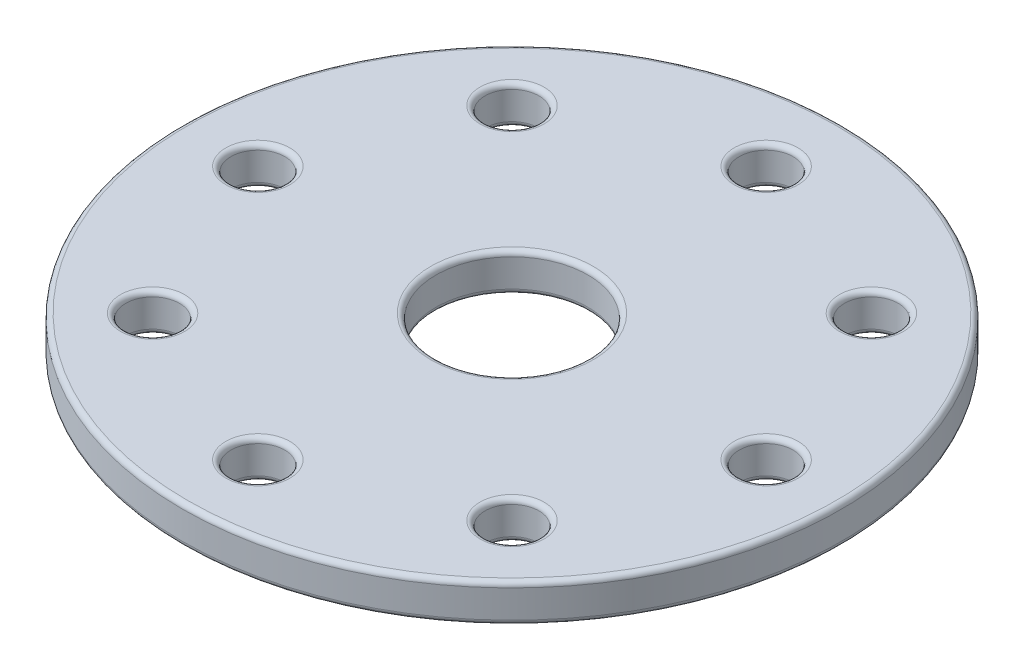
ISO-10303-21;
HEADER;
FILE_DESCRIPTION(('STEP AP214'),'2;1');
FILE_NAME('part.step','',(''),(''),'','','');
FILE_SCHEMA(('AUTOMOTIVE_DESIGN { 1 0 10303 214 1 1 1 1 }'));
ENDSEC;
DATA;
#1=APPLICATION_CONTEXT('core data for automotive mechanical design processes');
#2=APPLICATION_PROTOCOL_DEFINITION('international standard','automotive_design',2000,#1);
#3=PRODUCT_CONTEXT('',#1,'mechanical');
#4=PRODUCT('Part','Part','',(#3));
#5=PRODUCT_RELATED_PRODUCT_CATEGORY('part','',(#4));
#6=PRODUCT_DEFINITION_FORMATION('','',#4);
#7=PRODUCT_DEFINITION_CONTEXT('part definition',#1,'design');
#8=PRODUCT_DEFINITION('design','',#6,#7);
#9=PRODUCT_DEFINITION_SHAPE('','',#8);
#10=(LENGTH_UNIT() NAMED_UNIT(*) SI_UNIT(.MILLI.,.METRE.));
#11=(NAMED_UNIT(*) PLANE_ANGLE_UNIT() SI_UNIT($,.RADIAN.));
#12=(NAMED_UNIT(*) SI_UNIT($,.STERADIAN.) SOLID_ANGLE_UNIT());
#13=UNCERTAINTY_MEASURE_WITH_UNIT(LENGTH_MEASURE(1.E-05),#10,'distance_accuracy_value','');
#14=(GEOMETRIC_REPRESENTATION_CONTEXT(3) GLOBAL_UNCERTAINTY_ASSIGNED_CONTEXT((#13)) GLOBAL_UNIT_ASSIGNED_CONTEXT((#10,
#11,#12)) REPRESENTATION_CONTEXT('',''));
#15=CARTESIAN_POINT('',(0.,0.,0.));
#16=DIRECTION('',(0.,0.,1.));
#17=DIRECTION('',(1.,0.,0.));
#18=AXIS2_PLACEMENT_3D('',#15,#16,#17);
#19=CARTESIAN_POINT('',(0.,1.875,0.));
#20=DIRECTION('',(0.,-1.,0.));
#21=DIRECTION('',(0.,0.,-1.));
#22=AXIS2_PLACEMENT_3D('',#19,#20,#21);
#23=CYLINDRICAL_SURFACE('',#22,32.5);
#24=CARTESIAN_POINT('',(0.,-1.375,0.));
#25=DIRECTION('',(0.,1.,0.));
#26=DIRECTION('',(0.,0.,1.));
#27=AXIS2_PLACEMENT_3D('',#24,#25,#26);
#28=CIRCLE('',#27,32.5);
#29=CARTESIAN_POINT('',(0.,-1.375,32.5));
#30=VERTEX_POINT('',#29);
#31=EDGE_CURVE('E153',#30,#30,#28,.T.);
#32=ORIENTED_EDGE('',*,*,#31,.T.);
#33=EDGE_LOOP('',(#32));
#34=FACE_BOUND('',#33,.T.);
#35=CARTESIAN_POINT('',(0.,1.375,0.));
#36=DIRECTION('',(0.,1.,0.));
#37=DIRECTION('',(0.,0.,1.));
#38=AXIS2_PLACEMENT_3D('',#35,#36,#37);
#39=CIRCLE('',#38,32.5);
#40=CARTESIAN_POINT('',(0.,1.375,32.5));
#41=VERTEX_POINT('',#40);
#42=EDGE_CURVE('E156',#41,#41,#39,.F.);
#43=ORIENTED_EDGE('',*,*,#42,.T.);
#44=EDGE_LOOP('',(#43));
#45=FACE_BOUND('',#44,.T.);
#46=ADVANCED_FACE('F31',(#34,#45),#23,.T.);
#47=CARTESIAN_POINT('',(0.,1.875,0.));
#48=DIRECTION('',(0.,1.,0.));
#49=DIRECTION('',(0.,0.,1.));
#50=AXIS2_PLACEMENT_3D('',#47,#48,#49);
#51=PLANE('',#50);
#52=CARTESIAN_POINT('',(0.,1.875,0.));
#53=DIRECTION('',(0.,1.,0.));
#54=DIRECTION('',(0.,0.,1.));
#55=AXIS2_PLACEMENT_3D('',#52,#53,#54);
#56=CIRCLE('',#55,32.);
#57=CARTESIAN_POINT('',(0.,1.875,32.));
#58=VERTEX_POINT('',#57);
#59=EDGE_CURVE('E10',#58,#58,#56,.T.);
#60=ORIENTED_EDGE('',*,*,#59,.T.);
#61=EDGE_LOOP('',(#60));
#62=FACE_BOUND('',#61,.T.);
#63=CARTESIAN_POINT('',(0.,1.875,0.));
#64=DIRECTION('',(0.,1.,0.));
#65=DIRECTION('',(0.,0.,1.));
#66=AXIS2_PLACEMENT_3D('',#63,#64,#65);
#67=CIRCLE('',#66,8.);
#68=CARTESIAN_POINT('',(0.,1.875,8.));
#69=VERTEX_POINT('',#68);
#70=EDGE_CURVE('E38',#69,#69,#67,.F.);
#71=ORIENTED_EDGE('',*,*,#70,.T.);
#72=EDGE_LOOP('',(#71));
#73=FACE_BOUND('',#72,.T.);
#74=CARTESIAN_POINT('',(0.,1.875,-25.0625));
#75=DIRECTION('',(0.,1.,0.));
#76=DIRECTION('',(0.,0.,1.));
#77=AXIS2_PLACEMENT_3D('',#74,#75,#76);
#78=CIRCLE('',#77,3.15625);
#79=CARTESIAN_POINT('',(0.,1.875,-21.90625));
#80=VERTEX_POINT('',#79);
#81=EDGE_CURVE('E42',#80,#80,#78,.F.);
#82=ORIENTED_EDGE('',*,*,#81,.T.);
#83=EDGE_LOOP('',(#82));
#84=FACE_BOUND('',#83,.T.);
#85=CARTESIAN_POINT('',(-17.7218637034879,1.875,-17.7218637034878));
#86=DIRECTION('',(0.,1.,0.));
#87=DIRECTION('',(0.,0.,1.));
#88=AXIS2_PLACEMENT_3D('',#85,#86,#87);
#89=CIRCLE('',#88,3.15625);
#90=CARTESIAN_POINT('',(-17.7218637034879,1.875,-14.5656137034878));
#91=VERTEX_POINT('',#90);
#92=EDGE_CURVE('E46',#91,#91,#89,.F.);
#93=ORIENTED_EDGE('',*,*,#92,.T.);
#94=EDGE_LOOP('',(#93));
#95=FACE_BOUND('',#94,.T.);
#96=CARTESIAN_POINT('',(17.7218637034876,1.875,-17.7218637034881));
#97=DIRECTION('',(0.,1.,0.));
#98=DIRECTION('',(0.,0.,1.));
#99=AXIS2_PLACEMENT_3D('',#96,#97,#98);
#100=CIRCLE('',#99,3.15625);
#101=CARTESIAN_POINT('',(17.7218637034876,1.875,-14.5656137034881));
#102=VERTEX_POINT('',#101);
#103=EDGE_CURVE('E51',#102,#102,#100,.F.);
#104=ORIENTED_EDGE('',*,*,#103,.T.);
#105=EDGE_LOOP('',(#104));
#106=FACE_BOUND('',#105,.T.);
#107=CARTESIAN_POINT('',(25.0625,1.875,-2.61604922107402E-13));
#108=DIRECTION('',(0.,1.,0.));
#109=DIRECTION('',(0.,0.,1.));
#110=AXIS2_PLACEMENT_3D('',#107,#108,#109);
#111=CIRCLE('',#110,3.15625);
#112=CARTESIAN_POINT('',(25.0625,1.875,3.15624999999974));
#113=VERTEX_POINT('',#112);
#114=EDGE_CURVE('E54',#113,#113,#111,.F.);
#115=ORIENTED_EDGE('',*,*,#114,.T.);
#116=EDGE_LOOP('',(#115));
#117=FACE_BOUND('',#116,.T.);
#118=CARTESIAN_POINT('',(17.721863703488,1.875,17.7218637034877));
#119=DIRECTION('',(0.,1.,0.));
#120=DIRECTION('',(0.,0.,1.));
#121=AXIS2_PLACEMENT_3D('',#118,#119,#120);
#122=CIRCLE('',#121,3.15625);
#123=CARTESIAN_POINT('',(17.721863703488,1.875,20.8781137034877));
#124=VERTEX_POINT('',#123);
#125=EDGE_CURVE('E57',#124,#124,#122,.F.);
#126=ORIENTED_EDGE('',*,*,#125,.T.);
#127=EDGE_LOOP('',(#126));
#128=FACE_BOUND('',#127,.T.);
#129=CARTESIAN_POINT('',(0.,1.875,25.0625));
#130=DIRECTION('',(0.,1.,0.));
#131=DIRECTION('',(0.,0.,1.));
#132=AXIS2_PLACEMENT_3D('',#129,#130,#131);
#133=CIRCLE('',#132,3.15625);
#134=CARTESIAN_POINT('',(0.,1.875,28.21875));
#135=VERTEX_POINT('',#134);
#136=EDGE_CURVE('E60',#135,#135,#133,.F.);
#137=ORIENTED_EDGE('',*,*,#136,.T.);
#138=EDGE_LOOP('',(#137));
#139=FACE_BOUND('',#138,.T.);
#140=CARTESIAN_POINT('',(-17.7218637034878,1.875,17.7218637034879));
#141=DIRECTION('',(0.,1.,0.));
#142=DIRECTION('',(0.,0.,1.));
#143=AXIS2_PLACEMENT_3D('',#140,#141,#142);
#144=CIRCLE('',#143,3.15625);
#145=CARTESIAN_POINT('',(-17.7218637034878,1.875,20.8781137034879));
#146=VERTEX_POINT('',#145);
#147=EDGE_CURVE('E63',#146,#146,#144,.F.);
#148=ORIENTED_EDGE('',*,*,#147,.T.);
#149=EDGE_LOOP('',(#148));
#150=FACE_BOUND('',#149,.T.);
#151=CARTESIAN_POINT('',(-25.0625,1.875,0.));
#152=DIRECTION('',(0.,1.,0.));
#153=DIRECTION('',(0.,0.,1.));
#154=AXIS2_PLACEMENT_3D('',#151,#152,#153);
#155=CIRCLE('',#154,3.15625);
#156=CARTESIAN_POINT('',(-25.0625,1.875,3.15625000000009));
#157=VERTEX_POINT('',#156);
#158=EDGE_CURVE('E66',#157,#157,#155,.F.);
#159=ORIENTED_EDGE('',*,*,#158,.T.);
#160=EDGE_LOOP('',(#159));
#161=FACE_BOUND('',#160,.T.);
#162=ADVANCED_FACE('F178',(#62,#73,#84,#95,#106,#117,#128,#139,#150,#161),#51,.T.);
#163=CARTESIAN_POINT('',(0.,-1.875,0.));
#164=DIRECTION('',(0.,1.,0.));
#165=DIRECTION('',(0.,0.,1.));
#166=AXIS2_PLACEMENT_3D('',#163,#164,#165);
#167=PLANE('',#166);
#168=CARTESIAN_POINT('',(0.,-1.875,0.));
#169=DIRECTION('',(0.,1.,0.));
#170=DIRECTION('',(0.,0.,1.));
#171=AXIS2_PLACEMENT_3D('',#168,#169,#170);
#172=CIRCLE('',#171,32.);
#173=CARTESIAN_POINT('',(0.,-1.875,32.));
#174=VERTEX_POINT('',#173);
#175=EDGE_CURVE('E123',#174,#174,#172,.F.);
#176=ORIENTED_EDGE('',*,*,#175,.T.);
#177=EDGE_LOOP('',(#176));
#178=FACE_BOUND('',#177,.T.);
#179=CARTESIAN_POINT('',(0.,-1.875,0.));
#180=DIRECTION('',(0.,1.,0.));
#181=DIRECTION('',(0.,0.,1.));
#182=AXIS2_PLACEMENT_3D('',#179,#180,#181);
#183=CIRCLE('',#182,8.);
#184=CARTESIAN_POINT('',(0.,-1.875,8.));
#185=VERTEX_POINT('',#184);
#186=EDGE_CURVE('E126',#185,#185,#183,.T.);
#187=ORIENTED_EDGE('',*,*,#186,.T.);
#188=EDGE_LOOP('',(#187));
#189=FACE_BOUND('',#188,.T.);
#190=CARTESIAN_POINT('',(0.,-1.875,-25.0625));
#191=DIRECTION('',(0.,1.,0.));
#192=DIRECTION('',(0.,0.,1.));
#193=AXIS2_PLACEMENT_3D('',#190,#191,#192);
#194=CIRCLE('',#193,3.15625);
#195=CARTESIAN_POINT('',(0.,-1.875,-21.90625));
#196=VERTEX_POINT('',#195);
#197=EDGE_CURVE('E129',#196,#196,#194,.T.);
#198=ORIENTED_EDGE('',*,*,#197,.T.);
#199=EDGE_LOOP('',(#198));
#200=FACE_BOUND('',#199,.T.);
#201=CARTESIAN_POINT('',(-17.7218637034879,-1.875,-17.7218637034878));
#202=DIRECTION('',(0.,1.,0.));
#203=DIRECTION('',(0.,0.,1.));
#204=AXIS2_PLACEMENT_3D('',#201,#202,#203);
#205=CIRCLE('',#204,3.15625);
#206=CARTESIAN_POINT('',(-17.7218637034879,-1.875,-14.5656137034878));
#207=VERTEX_POINT('',#206);
#208=EDGE_CURVE('E132',#207,#207,#205,.T.);
#209=ORIENTED_EDGE('',*,*,#208,.T.);
#210=EDGE_LOOP('',(#209));
#211=FACE_BOUND('',#210,.T.);
#212=CARTESIAN_POINT('',(17.7218637034876,-1.875,-17.7218637034881));
#213=DIRECTION('',(0.,1.,0.));
#214=DIRECTION('',(0.,0.,1.));
#215=AXIS2_PLACEMENT_3D('',#212,#213,#214);
#216=CIRCLE('',#215,3.15625);
#217=CARTESIAN_POINT('',(17.7218637034876,-1.875,-14.5656137034881));
#218=VERTEX_POINT('',#217);
#219=EDGE_CURVE('E135',#218,#218,#216,.T.);
#220=ORIENTED_EDGE('',*,*,#219,.T.);
#221=EDGE_LOOP('',(#220));
#222=FACE_BOUND('',#221,.T.);
#223=CARTESIAN_POINT('',(25.0625,-1.875,-2.61604922107402E-13));
#224=DIRECTION('',(0.,1.,0.));
#225=DIRECTION('',(0.,0.,1.));
#226=AXIS2_PLACEMENT_3D('',#223,#224,#225);
#227=CIRCLE('',#226,3.15625);
#228=CARTESIAN_POINT('',(25.0625,-1.875,3.15624999999974));
#229=VERTEX_POINT('',#228);
#230=EDGE_CURVE('E138',#229,#229,#227,.T.);
#231=ORIENTED_EDGE('',*,*,#230,.T.);
#232=EDGE_LOOP('',(#231));
#233=FACE_BOUND('',#232,.T.);
#234=CARTESIAN_POINT('',(17.721863703488,-1.875,17.7218637034877));
#235=DIRECTION('',(0.,1.,0.));
#236=DIRECTION('',(0.,0.,1.));
#237=AXIS2_PLACEMENT_3D('',#234,#235,#236);
#238=CIRCLE('',#237,3.15625);
#239=CARTESIAN_POINT('',(17.721863703488,-1.875,20.8781137034877));
#240=VERTEX_POINT('',#239);
#241=EDGE_CURVE('E141',#240,#240,#238,.T.);
#242=ORIENTED_EDGE('',*,*,#241,.T.);
#243=EDGE_LOOP('',(#242));
#244=FACE_BOUND('',#243,.T.);
#245=CARTESIAN_POINT('',(0.,-1.875,25.0625));
#246=DIRECTION('',(0.,1.,0.));
#247=DIRECTION('',(0.,0.,1.));
#248=AXIS2_PLACEMENT_3D('',#245,#246,#247);
#249=CIRCLE('',#248,3.15625);
#250=CARTESIAN_POINT('',(0.,-1.875,28.21875));
#251=VERTEX_POINT('',#250);
#252=EDGE_CURVE('E144',#251,#251,#249,.T.);
#253=ORIENTED_EDGE('',*,*,#252,.T.);
#254=EDGE_LOOP('',(#253));
#255=FACE_BOUND('',#254,.T.);
#256=CARTESIAN_POINT('',(-17.7218637034878,-1.875,17.7218637034879));
#257=DIRECTION('',(0.,1.,0.));
#258=DIRECTION('',(0.,0.,1.));
#259=AXIS2_PLACEMENT_3D('',#256,#257,#258);
#260=CIRCLE('',#259,3.15625);
#261=CARTESIAN_POINT('',(-17.7218637034878,-1.875,20.8781137034879));
#262=VERTEX_POINT('',#261);
#263=EDGE_CURVE('E147',#262,#262,#260,.T.);
#264=ORIENTED_EDGE('',*,*,#263,.T.);
#265=EDGE_LOOP('',(#264));
#266=FACE_BOUND('',#265,.T.);
#267=CARTESIAN_POINT('',(-25.0625,-1.875,0.));
#268=DIRECTION('',(0.,1.,0.));
#269=DIRECTION('',(0.,0.,1.));
#270=AXIS2_PLACEMENT_3D('',#267,#268,#269);
#271=CIRCLE('',#270,3.15625);
#272=CARTESIAN_POINT('',(-25.0625,-1.875,3.15625000000009));
#273=VERTEX_POINT('',#272);
#274=EDGE_CURVE('E150',#273,#273,#271,.T.);
#275=ORIENTED_EDGE('',*,*,#274,.T.);
#276=EDGE_LOOP('',(#275));
#277=FACE_BOUND('',#276,.T.);
#278=ADVANCED_FACE('F184',(#178,#189,#200,#211,#222,#233,#244,#255,#266,#277),#167,.F.);
#279=CARTESIAN_POINT('',(0.,-1.875,0.));
#280=DIRECTION('',(0.,1.,0.));
#281=DIRECTION('',(0.,0.,1.));
#282=AXIS2_PLACEMENT_3D('',#279,#280,#281);
#283=CYLINDRICAL_SURFACE('',#282,7.5);
#284=CARTESIAN_POINT('',(0.,-1.375,0.));
#285=DIRECTION('',(0.,1.,0.));
#286=DIRECTION('',(0.,0.,1.));
#287=AXIS2_PLACEMENT_3D('',#284,#285,#286);
#288=CIRCLE('',#287,7.5);
#289=CARTESIAN_POINT('',(0.,-1.375,7.5));
#290=VERTEX_POINT('',#289);
#291=EDGE_CURVE('E117',#290,#290,#288,.F.);
#292=ORIENTED_EDGE('',*,*,#291,.T.);
#293=EDGE_LOOP('',(#292));
#294=FACE_BOUND('',#293,.T.);
#295=CARTESIAN_POINT('',(0.,1.375,0.));
#296=DIRECTION('',(0.,1.,0.));
#297=DIRECTION('',(0.,0.,1.));
#298=AXIS2_PLACEMENT_3D('',#295,#296,#297);
#299=CIRCLE('',#298,7.5);
#300=CARTESIAN_POINT('',(0.,1.375,7.5));
#301=VERTEX_POINT('',#300);
#302=EDGE_CURVE('E120',#301,#301,#299,.T.);
#303=ORIENTED_EDGE('',*,*,#302,.T.);
#304=EDGE_LOOP('',(#303));
#305=FACE_BOUND('',#304,.T.);
#306=ADVANCED_FACE('F231',(#294,#305),#283,.F.);
#307=CARTESIAN_POINT('',(0.,-1.875,-25.0625));
#308=DIRECTION('',(0.,1.,0.));
#309=DIRECTION('',(0.,0.,1.));
#310=AXIS2_PLACEMENT_3D('',#307,#308,#309);
#311=CYLINDRICAL_SURFACE('',#310,2.65625);
#312=CARTESIAN_POINT('',(0.,-1.375,-25.0625));
#313=DIRECTION('',(0.,1.,0.));
#314=DIRECTION('',(0.,0.,1.));
#315=AXIS2_PLACEMENT_3D('',#312,#313,#314);
#316=CIRCLE('',#315,2.65625);
#317=CARTESIAN_POINT('',(0.,-1.375,-22.40625));
#318=VERTEX_POINT('',#317);
#319=EDGE_CURVE('E111',#318,#318,#316,.F.);
#320=ORIENTED_EDGE('',*,*,#319,.T.);
#321=EDGE_LOOP('',(#320));
#322=FACE_BOUND('',#321,.T.);
#323=CARTESIAN_POINT('',(0.,1.375,-25.0625));
#324=DIRECTION('',(0.,1.,0.));
#325=DIRECTION('',(0.,0.,1.));
#326=AXIS2_PLACEMENT_3D('',#323,#324,#325);
#327=CIRCLE('',#326,2.65625);
#328=CARTESIAN_POINT('',(0.,1.375,-22.40625));
#329=VERTEX_POINT('',#328);
#330=EDGE_CURVE('E114',#329,#329,#327,.T.);
#331=ORIENTED_EDGE('',*,*,#330,.T.);
#332=EDGE_LOOP('',(#331));
#333=FACE_BOUND('',#332,.T.);
#334=ADVANCED_FACE('F238',(#322,#333),#311,.F.);
#335=CARTESIAN_POINT('',(-17.7218637034879,-1.875,-17.7218637034878));
#336=DIRECTION('',(0.,1.,0.));
#337=DIRECTION('',(0.,0.,1.));
#338=AXIS2_PLACEMENT_3D('',#335,#336,#337);
#339=CYLINDRICAL_SURFACE('',#338,2.65625);
#340=CARTESIAN_POINT('',(-17.7218637034879,-1.375,-17.7218637034878));
#341=DIRECTION('',(0.,1.,0.));
#342=DIRECTION('',(0.,0.,1.));
#343=AXIS2_PLACEMENT_3D('',#340,#341,#342);
#344=CIRCLE('',#343,2.65625);
#345=CARTESIAN_POINT('',(-17.7218637034879,-1.375,-15.0656137034878));
#346=VERTEX_POINT('',#345);
#347=EDGE_CURVE('E105',#346,#346,#344,.F.);
#348=ORIENTED_EDGE('',*,*,#347,.T.);
#349=EDGE_LOOP('',(#348));
#350=FACE_BOUND('',#349,.T.);
#351=CARTESIAN_POINT('',(-17.7218637034879,1.375,-17.7218637034878));
#352=DIRECTION('',(0.,1.,0.));
#353=DIRECTION('',(0.,0.,1.));
#354=AXIS2_PLACEMENT_3D('',#351,#352,#353);
#355=CIRCLE('',#354,2.65625);
#356=CARTESIAN_POINT('',(-17.7218637034879,1.375,-15.0656137034878));
#357=VERTEX_POINT('',#356);
#358=EDGE_CURVE('E108',#357,#357,#355,.T.);
#359=ORIENTED_EDGE('',*,*,#358,.T.);
#360=EDGE_LOOP('',(#359));
#361=FACE_BOUND('',#360,.T.);
#362=ADVANCED_FACE('F268',(#350,#361),#339,.F.);
#363=CARTESIAN_POINT('',(17.7218637034876,-1.875,-17.7218637034881));
#364=DIRECTION('',(0.,1.,0.));
#365=DIRECTION('',(0.,0.,1.));
#366=AXIS2_PLACEMENT_3D('',#363,#364,#365);
#367=CYLINDRICAL_SURFACE('',#366,2.65625);
#368=CARTESIAN_POINT('',(17.7218637034876,-1.375,-17.7218637034881));
#369=DIRECTION('',(0.,1.,0.));
#370=DIRECTION('',(0.,0.,1.));
#371=AXIS2_PLACEMENT_3D('',#368,#369,#370);
#372=CIRCLE('',#371,2.65625);
#373=CARTESIAN_POINT('',(17.7218637034876,-1.375,-15.0656137034881));
#374=VERTEX_POINT('',#373);
#375=EDGE_CURVE('E99',#374,#374,#372,.F.);
#376=ORIENTED_EDGE('',*,*,#375,.T.);
#377=EDGE_LOOP('',(#376));
#378=FACE_BOUND('',#377,.T.);
#379=CARTESIAN_POINT('',(17.7218637034876,1.375,-17.7218637034881));
#380=DIRECTION('',(0.,1.,0.));
#381=DIRECTION('',(0.,0.,1.));
#382=AXIS2_PLACEMENT_3D('',#379,#380,#381);
#383=CIRCLE('',#382,2.65625);
#384=CARTESIAN_POINT('',(17.7218637034876,1.375,-15.0656137034881));
#385=VERTEX_POINT('',#384);
#386=EDGE_CURVE('E102',#385,#385,#383,.T.);
#387=ORIENTED_EDGE('',*,*,#386,.T.);
#388=EDGE_LOOP('',(#387));
#389=FACE_BOUND('',#388,.T.);
#390=ADVANCED_FACE('F275',(#378,#389),#367,.F.);
#391=CARTESIAN_POINT('',(25.0625,-1.875,-2.61604922107402E-13));
#392=DIRECTION('',(0.,1.,0.));
#393=DIRECTION('',(0.,0.,1.));
#394=AXIS2_PLACEMENT_3D('',#391,#392,#393);
#395=CYLINDRICAL_SURFACE('',#394,2.65625);
#396=CARTESIAN_POINT('',(25.0625,-1.375,-2.61604922107402E-13));
#397=DIRECTION('',(0.,1.,0.));
#398=DIRECTION('',(0.,0.,1.));
#399=AXIS2_PLACEMENT_3D('',#396,#397,#398);
#400=CIRCLE('',#399,2.65625);
#401=CARTESIAN_POINT('',(25.0625,-1.375,2.65624999999974));
#402=VERTEX_POINT('',#401);
#403=EDGE_CURVE('E93',#402,#402,#400,.F.);
#404=ORIENTED_EDGE('',*,*,#403,.T.);
#405=EDGE_LOOP('',(#404));
#406=FACE_BOUND('',#405,.T.);
#407=CARTESIAN_POINT('',(25.0625,1.375,-2.61604922107402E-13));
#408=DIRECTION('',(0.,1.,0.));
#409=DIRECTION('',(0.,0.,1.));
#410=AXIS2_PLACEMENT_3D('',#407,#408,#409);
#411=CIRCLE('',#410,2.65625);
#412=CARTESIAN_POINT('',(25.0625,1.375,2.65624999999974));
#413=VERTEX_POINT('',#412);
#414=EDGE_CURVE('E96',#413,#413,#411,.T.);
#415=ORIENTED_EDGE('',*,*,#414,.T.);
#416=EDGE_LOOP('',(#415));
#417=FACE_BOUND('',#416,.T.);
#418=ADVANCED_FACE('F281',(#406,#417),#395,.F.);
#419=CARTESIAN_POINT('',(17.721863703488,-1.875,17.7218637034877));
#420=DIRECTION('',(0.,1.,0.));
#421=DIRECTION('',(0.,0.,1.));
#422=AXIS2_PLACEMENT_3D('',#419,#420,#421);
#423=CYLINDRICAL_SURFACE('',#422,2.65625);
#424=CARTESIAN_POINT('',(17.721863703488,-1.375,17.7218637034877));
#425=DIRECTION('',(0.,1.,0.));
#426=DIRECTION('',(0.,0.,1.));
#427=AXIS2_PLACEMENT_3D('',#424,#425,#426);
#428=CIRCLE('',#427,2.65625);
#429=CARTESIAN_POINT('',(17.721863703488,-1.375,20.3781137034877));
#430=VERTEX_POINT('',#429);
#431=EDGE_CURVE('E87',#430,#430,#428,.F.);
#432=ORIENTED_EDGE('',*,*,#431,.T.);
#433=EDGE_LOOP('',(#432));
#434=FACE_BOUND('',#433,.T.);
#435=CARTESIAN_POINT('',(17.721863703488,1.375,17.7218637034877));
#436=DIRECTION('',(0.,1.,0.));
#437=DIRECTION('',(0.,0.,1.));
#438=AXIS2_PLACEMENT_3D('',#435,#436,#437);
#439=CIRCLE('',#438,2.65625);
#440=CARTESIAN_POINT('',(17.721863703488,1.375,20.3781137034877));
#441=VERTEX_POINT('',#440);
#442=EDGE_CURVE('E90',#441,#441,#439,.T.);
#443=ORIENTED_EDGE('',*,*,#442,.T.);
#444=EDGE_LOOP('',(#443));
#445=FACE_BOUND('',#444,.T.);
#446=ADVANCED_FACE('F277',(#434,#445),#423,.F.);
#447=CARTESIAN_POINT('',(0.,-1.875,25.0625));
#448=DIRECTION('',(0.,1.,0.));
#449=DIRECTION('',(0.,0.,1.));
#450=AXIS2_PLACEMENT_3D('',#447,#448,#449);
#451=CYLINDRICAL_SURFACE('',#450,2.65625);
#452=CARTESIAN_POINT('',(0.,-1.375,25.0625));
#453=DIRECTION('',(0.,1.,0.));
#454=DIRECTION('',(0.,0.,1.));
#455=AXIS2_PLACEMENT_3D('',#452,#453,#454);
#456=CIRCLE('',#455,2.65625);
#457=CARTESIAN_POINT('',(0.,-1.375,27.71875));
#458=VERTEX_POINT('',#457);
#459=EDGE_CURVE('E81',#458,#458,#456,.F.);
#460=ORIENTED_EDGE('',*,*,#459,.T.);
#461=EDGE_LOOP('',(#460));
#462=FACE_BOUND('',#461,.T.);
#463=CARTESIAN_POINT('',(0.,1.375,25.0625));
#464=DIRECTION('',(0.,1.,0.));
#465=DIRECTION('',(0.,0.,1.));
#466=AXIS2_PLACEMENT_3D('',#463,#464,#465);
#467=CIRCLE('',#466,2.65625);
#468=CARTESIAN_POINT('',(0.,1.375,27.71875));
#469=VERTEX_POINT('',#468);
#470=EDGE_CURVE('E84',#469,#469,#467,.T.);
#471=ORIENTED_EDGE('',*,*,#470,.T.);
#472=EDGE_LOOP('',(#471));
#473=FACE_BOUND('',#472,.T.);
#474=ADVANCED_FACE('F280',(#462,#473),#451,.F.);
#475=CARTESIAN_POINT('',(-17.7218637034878,-1.875,17.7218637034879));
#476=DIRECTION('',(0.,1.,0.));
#477=DIRECTION('',(0.,0.,1.));
#478=AXIS2_PLACEMENT_3D('',#475,#476,#477);
#479=CYLINDRICAL_SURFACE('',#478,2.65625);
#480=CARTESIAN_POINT('',(-17.7218637034878,-1.375,17.7218637034879));
#481=DIRECTION('',(0.,1.,0.));
#482=DIRECTION('',(0.,0.,1.));
#483=AXIS2_PLACEMENT_3D('',#480,#481,#482);
#484=CIRCLE('',#483,2.65625);
#485=CARTESIAN_POINT('',(-17.7218637034878,-1.375,20.3781137034879));
#486=VERTEX_POINT('',#485);
#487=EDGE_CURVE('E75',#486,#486,#484,.F.);
#488=ORIENTED_EDGE('',*,*,#487,.T.);
#489=EDGE_LOOP('',(#488));
#490=FACE_BOUND('',#489,.T.);
#491=CARTESIAN_POINT('',(-17.7218637034878,1.375,17.7218637034879));
#492=DIRECTION('',(0.,1.,0.));
#493=DIRECTION('',(0.,0.,1.));
#494=AXIS2_PLACEMENT_3D('',#491,#492,#493);
#495=CIRCLE('',#494,2.65625);
#496=CARTESIAN_POINT('',(-17.7218637034878,1.375,20.3781137034879));
#497=VERTEX_POINT('',#496);
#498=EDGE_CURVE('E78',#497,#497,#495,.T.);
#499=ORIENTED_EDGE('',*,*,#498,.T.);
#500=EDGE_LOOP('',(#499));
#501=FACE_BOUND('',#500,.T.);
#502=ADVANCED_FACE('F285',(#490,#501),#479,.F.);
#503=CARTESIAN_POINT('',(-25.0625,-1.875,0.));
#504=DIRECTION('',(0.,1.,0.));
#505=DIRECTION('',(0.,0.,1.));
#506=AXIS2_PLACEMENT_3D('',#503,#504,#505);
#507=CYLINDRICAL_SURFACE('',#506,2.65625);
#508=CARTESIAN_POINT('',(-25.0625,-1.375,0.));
#509=DIRECTION('',(0.,1.,0.));
#510=DIRECTION('',(0.,0.,1.));
#511=AXIS2_PLACEMENT_3D('',#508,#509,#510);
#512=CIRCLE('',#511,2.65625);
#513=CARTESIAN_POINT('',(-25.0625,-1.375,2.65625000000009));
#514=VERTEX_POINT('',#513);
#515=EDGE_CURVE('E69',#514,#514,#512,.F.);
#516=ORIENTED_EDGE('',*,*,#515,.T.);
#517=EDGE_LOOP('',(#516));
#518=FACE_BOUND('',#517,.T.);
#519=CARTESIAN_POINT('',(-25.0625,1.375,0.));
#520=DIRECTION('',(0.,1.,0.));
#521=DIRECTION('',(0.,0.,1.));
#522=AXIS2_PLACEMENT_3D('',#519,#520,#521);
#523=CIRCLE('',#522,2.65625);
#524=CARTESIAN_POINT('',(-25.0625,1.375,2.65625000000009));
#525=VERTEX_POINT('',#524);
#526=EDGE_CURVE('E72',#525,#525,#523,.T.);
#527=ORIENTED_EDGE('',*,*,#526,.T.);
#528=EDGE_LOOP('',(#527));
#529=FACE_BOUND('',#528,.T.);
#530=ADVANCED_FACE('F192',(#518,#529),#507,.F.);
#531=CARTESIAN_POINT('',(0.,-1.375,0.));
#532=DIRECTION('',(0.,1.,0.));
#533=DIRECTION('',(0.,0.,1.));
#534=AXIS2_PLACEMENT_3D('',#531,#532,#533);
#535=TOROIDAL_SURFACE('',#534,32.,0.5);
#536=ORIENTED_EDGE('',*,*,#175,.F.);
#537=EDGE_LOOP('',(#536));
#538=FACE_BOUND('',#537,.T.);
#539=ORIENTED_EDGE('',*,*,#31,.F.);
#540=EDGE_LOOP('',(#539));
#541=FACE_BOUND('',#540,.T.);
#542=ADVANCED_FACE('F188',(#538,#541),#535,.T.);
#543=CARTESIAN_POINT('',(0.,-1.375,0.));
#544=DIRECTION('',(0.,1.,0.));
#545=DIRECTION('',(0.,0.,1.));
#546=AXIS2_PLACEMENT_3D('',#543,#544,#545);
#547=TOROIDAL_SURFACE('',#546,8.,0.5);
#548=ORIENTED_EDGE('',*,*,#291,.F.);
#549=EDGE_LOOP('',(#548));
#550=FACE_BOUND('',#549,.T.);
#551=ORIENTED_EDGE('',*,*,#186,.F.);
#552=EDGE_LOOP('',(#551));
#553=FACE_BOUND('',#552,.T.);
#554=ADVANCED_FACE('F191',(#550,#553),#547,.T.);
#555=CARTESIAN_POINT('',(0.,-1.375,-25.0625));
#556=DIRECTION('',(0.,1.,0.));
#557=DIRECTION('',(0.,0.,1.));
#558=AXIS2_PLACEMENT_3D('',#555,#556,#557);
#559=TOROIDAL_SURFACE('',#558,3.15625,0.5);
#560=ORIENTED_EDGE('',*,*,#319,.F.);
#561=EDGE_LOOP('',(#560));
#562=FACE_BOUND('',#561,.T.);
#563=ORIENTED_EDGE('',*,*,#197,.F.);
#564=EDGE_LOOP('',(#563));
#565=FACE_BOUND('',#564,.T.);
#566=ADVANCED_FACE('F196',(#562,#565),#559,.T.);
#567=CARTESIAN_POINT('',(-17.7218637034879,-1.375,-17.7218637034878));
#568=DIRECTION('',(0.,1.,0.));
#569=DIRECTION('',(0.,0.,1.));
#570=AXIS2_PLACEMENT_3D('',#567,#568,#569);
#571=TOROIDAL_SURFACE('',#570,3.15625,0.5);
#572=ORIENTED_EDGE('',*,*,#347,.F.);
#573=EDGE_LOOP('',(#572));
#574=FACE_BOUND('',#573,.T.);
#575=ORIENTED_EDGE('',*,*,#208,.F.);
#576=EDGE_LOOP('',(#575));
#577=FACE_BOUND('',#576,.T.);
#578=ADVANCED_FACE('F200',(#574,#577),#571,.T.);
#579=CARTESIAN_POINT('',(17.7218637034876,-1.375,-17.7218637034881));
#580=DIRECTION('',(0.,1.,0.));
#581=DIRECTION('',(0.,0.,1.));
#582=AXIS2_PLACEMENT_3D('',#579,#580,#581);
#583=TOROIDAL_SURFACE('',#582,3.15625,0.5);
#584=ORIENTED_EDGE('',*,*,#375,.F.);
#585=EDGE_LOOP('',(#584));
#586=FACE_BOUND('',#585,.T.);
#587=ORIENTED_EDGE('',*,*,#219,.F.);
#588=EDGE_LOOP('',(#587));
#589=FACE_BOUND('',#588,.T.);
#590=ADVANCED_FACE('F204',(#586,#589),#583,.T.);
#591=CARTESIAN_POINT('',(25.0625,-1.375,-2.61604922107402E-13));
#592=DIRECTION('',(0.,1.,0.));
#593=DIRECTION('',(0.,0.,1.));
#594=AXIS2_PLACEMENT_3D('',#591,#592,#593);
#595=TOROIDAL_SURFACE('',#594,3.15625,0.5);
#596=ORIENTED_EDGE('',*,*,#403,.F.);
#597=EDGE_LOOP('',(#596));
#598=FACE_BOUND('',#597,.T.);
#599=ORIENTED_EDGE('',*,*,#230,.F.);
#600=EDGE_LOOP('',(#599));
#601=FACE_BOUND('',#600,.T.);
#602=ADVANCED_FACE('F208',(#598,#601),#595,.T.);
#603=CARTESIAN_POINT('',(17.721863703488,-1.375,17.7218637034877));
#604=DIRECTION('',(0.,1.,0.));
#605=DIRECTION('',(0.,0.,1.));
#606=AXIS2_PLACEMENT_3D('',#603,#604,#605);
#607=TOROIDAL_SURFACE('',#606,3.15625,0.5);
#608=ORIENTED_EDGE('',*,*,#431,.F.);
#609=EDGE_LOOP('',(#608));
#610=FACE_BOUND('',#609,.T.);
#611=ORIENTED_EDGE('',*,*,#241,.F.);
#612=EDGE_LOOP('',(#611));
#613=FACE_BOUND('',#612,.T.);
#614=ADVANCED_FACE('F212',(#610,#613),#607,.T.);
#615=CARTESIAN_POINT('',(0.,-1.375,25.0625));
#616=DIRECTION('',(0.,1.,0.));
#617=DIRECTION('',(0.,0.,1.));
#618=AXIS2_PLACEMENT_3D('',#615,#616,#617);
#619=TOROIDAL_SURFACE('',#618,3.15625,0.5);
#620=ORIENTED_EDGE('',*,*,#459,.F.);
#621=EDGE_LOOP('',(#620));
#622=FACE_BOUND('',#621,.T.);
#623=ORIENTED_EDGE('',*,*,#252,.F.);
#624=EDGE_LOOP('',(#623));
#625=FACE_BOUND('',#624,.T.);
#626=ADVANCED_FACE('F216',(#622,#625),#619,.T.);
#627=CARTESIAN_POINT('',(-17.7218637034878,-1.375,17.7218637034879));
#628=DIRECTION('',(0.,1.,0.));
#629=DIRECTION('',(0.,0.,1.));
#630=AXIS2_PLACEMENT_3D('',#627,#628,#629);
#631=TOROIDAL_SURFACE('',#630,3.15625,0.5);
#632=ORIENTED_EDGE('',*,*,#487,.F.);
#633=EDGE_LOOP('',(#632));
#634=FACE_BOUND('',#633,.T.);
#635=ORIENTED_EDGE('',*,*,#263,.F.);
#636=EDGE_LOOP('',(#635));
#637=FACE_BOUND('',#636,.T.);
#638=ADVANCED_FACE('F174',(#634,#637),#631,.T.);
#639=CARTESIAN_POINT('',(-25.0625,-1.375,0.));
#640=DIRECTION('',(0.,1.,0.));
#641=DIRECTION('',(0.,0.,1.));
#642=AXIS2_PLACEMENT_3D('',#639,#640,#641);
#643=TOROIDAL_SURFACE('',#642,3.15625,0.5);
#644=ORIENTED_EDGE('',*,*,#515,.F.);
#645=EDGE_LOOP('',(#644));
#646=FACE_BOUND('',#645,.T.);
#647=ORIENTED_EDGE('',*,*,#274,.F.);
#648=EDGE_LOOP('',(#647));
#649=FACE_BOUND('',#648,.T.);
#650=ADVANCED_FACE('F165',(#646,#649),#643,.T.);
#651=CARTESIAN_POINT('',(0.,1.375,0.));
#652=DIRECTION('',(0.,1.,0.));
#653=DIRECTION('',(0.,0.,1.));
#654=AXIS2_PLACEMENT_3D('',#651,#652,#653);
#655=TOROIDAL_SURFACE('',#654,32.,0.5);
#656=ORIENTED_EDGE('',*,*,#42,.F.);
#657=EDGE_LOOP('',(#656));
#658=FACE_BOUND('',#657,.T.);
#659=ORIENTED_EDGE('',*,*,#59,.F.);
#660=EDGE_LOOP('',(#659));
#661=FACE_BOUND('',#660,.T.);
#662=ADVANCED_FACE('F161',(#658,#661),#655,.T.);
#663=CARTESIAN_POINT('',(0.,1.375,0.));
#664=DIRECTION('',(0.,1.,0.));
#665=DIRECTION('',(0.,0.,1.));
#666=AXIS2_PLACEMENT_3D('',#663,#664,#665);
#667=TOROIDAL_SURFACE('',#666,8.,0.5);
#668=ORIENTED_EDGE('',*,*,#70,.F.);
#669=EDGE_LOOP('',(#668));
#670=FACE_BOUND('',#669,.T.);
#671=ORIENTED_EDGE('',*,*,#302,.F.);
#672=EDGE_LOOP('',(#671));
#673=FACE_BOUND('',#672,.T.);
#674=ADVANCED_FACE('F164',(#670,#673),#667,.T.);
#675=CARTESIAN_POINT('',(0.,1.375,-25.0625));
#676=DIRECTION('',(0.,1.,0.));
#677=DIRECTION('',(0.,0.,1.));
#678=AXIS2_PLACEMENT_3D('',#675,#676,#677);
#679=TOROIDAL_SURFACE('',#678,3.15625,0.5);
#680=ORIENTED_EDGE('',*,*,#81,.F.);
#681=EDGE_LOOP('',(#680));
#682=FACE_BOUND('',#681,.T.);
#683=ORIENTED_EDGE('',*,*,#330,.F.);
#684=EDGE_LOOP('',(#683));
#685=FACE_BOUND('',#684,.T.);
#686=ADVANCED_FACE('F171',(#682,#685),#679,.T.);
#687=CARTESIAN_POINT('',(-17.7218637034879,1.375,-17.7218637034878));
#688=DIRECTION('',(0.,1.,0.));
#689=DIRECTION('',(0.,0.,1.));
#690=AXIS2_PLACEMENT_3D('',#687,#688,#689);
#691=TOROIDAL_SURFACE('',#690,3.15625,0.5);
#692=ORIENTED_EDGE('',*,*,#92,.F.);
#693=EDGE_LOOP('',(#692));
#694=FACE_BOUND('',#693,.T.);
#695=ORIENTED_EDGE('',*,*,#358,.F.);
#696=EDGE_LOOP('',(#695));
#697=FACE_BOUND('',#696,.T.);
#698=ADVANCED_FACE('F317',(#694,#697),#691,.T.);
#699=CARTESIAN_POINT('',(17.7218637034876,1.375,-17.7218637034881));
#700=DIRECTION('',(0.,1.,0.));
#701=DIRECTION('',(0.,0.,1.));
#702=AXIS2_PLACEMENT_3D('',#699,#700,#701);
#703=TOROIDAL_SURFACE('',#702,3.15625,0.5);
#704=ORIENTED_EDGE('',*,*,#103,.F.);
#705=EDGE_LOOP('',(#704));
#706=FACE_BOUND('',#705,.T.);
#707=ORIENTED_EDGE('',*,*,#386,.F.);
#708=EDGE_LOOP('',(#707));
#709=FACE_BOUND('',#708,.T.);
#710=ADVANCED_FACE('F307',(#706,#709),#703,.T.);
#711=CARTESIAN_POINT('',(25.0625,1.375,-2.61604922107402E-13));
#712=DIRECTION('',(0.,1.,0.));
#713=DIRECTION('',(0.,0.,1.));
#714=AXIS2_PLACEMENT_3D('',#711,#712,#713);
#715=TOROIDAL_SURFACE('',#714,3.15625,0.5);
#716=ORIENTED_EDGE('',*,*,#114,.F.);
#717=EDGE_LOOP('',(#716));
#718=FACE_BOUND('',#717,.T.);
#719=ORIENTED_EDGE('',*,*,#414,.F.);
#720=EDGE_LOOP('',(#719));
#721=FACE_BOUND('',#720,.T.);
#722=ADVANCED_FACE('F304',(#718,#721),#715,.T.);
#723=CARTESIAN_POINT('',(17.721863703488,1.375,17.7218637034877));
#724=DIRECTION('',(0.,1.,0.));
#725=DIRECTION('',(0.,0.,1.));
#726=AXIS2_PLACEMENT_3D('',#723,#724,#725);
#727=TOROIDAL_SURFACE('',#726,3.15625,0.5);
#728=ORIENTED_EDGE('',*,*,#125,.F.);
#729=EDGE_LOOP('',(#728));
#730=FACE_BOUND('',#729,.T.);
#731=ORIENTED_EDGE('',*,*,#442,.F.);
#732=EDGE_LOOP('',(#731));
#733=FACE_BOUND('',#732,.T.);
#734=ADVANCED_FACE('F306',(#730,#733),#727,.T.);
#735=CARTESIAN_POINT('',(0.,1.375,25.0625));
#736=DIRECTION('',(0.,1.,0.));
#737=DIRECTION('',(0.,0.,1.));
#738=AXIS2_PLACEMENT_3D('',#735,#736,#737);
#739=TOROIDAL_SURFACE('',#738,3.15625,0.5);
#740=ORIENTED_EDGE('',*,*,#136,.F.);
#741=EDGE_LOOP('',(#740));
#742=FACE_BOUND('',#741,.T.);
#743=ORIENTED_EDGE('',*,*,#470,.F.);
#744=EDGE_LOOP('',(#743));
#745=FACE_BOUND('',#744,.T.);
#746=ADVANCED_FACE('F314',(#742,#745),#739,.T.);
#747=CARTESIAN_POINT('',(-17.7218637034878,1.375,17.7218637034879));
#748=DIRECTION('',(0.,1.,0.));
#749=DIRECTION('',(0.,0.,1.));
#750=AXIS2_PLACEMENT_3D('',#747,#748,#749);
#751=TOROIDAL_SURFACE('',#750,3.15625,0.5);
#752=ORIENTED_EDGE('',*,*,#147,.F.);
#753=EDGE_LOOP('',(#752));
#754=FACE_BOUND('',#753,.T.);
#755=ORIENTED_EDGE('',*,*,#498,.F.);
#756=EDGE_LOOP('',(#755));
#757=FACE_BOUND('',#756,.T.);
#758=ADVANCED_FACE('F324',(#754,#757),#751,.T.);
#759=CARTESIAN_POINT('',(-25.0625,1.375,0.));
#760=DIRECTION('',(0.,1.,0.));
#761=DIRECTION('',(0.,0.,1.));
#762=AXIS2_PLACEMENT_3D('',#759,#760,#761);
#763=TOROIDAL_SURFACE('',#762,3.15625,0.5);
#764=ORIENTED_EDGE('',*,*,#158,.F.);
#765=EDGE_LOOP('',(#764));
#766=FACE_BOUND('',#765,.T.);
#767=ORIENTED_EDGE('',*,*,#526,.F.);
#768=EDGE_LOOP('',(#767));
#769=FACE_BOUND('',#768,.T.);
#770=ADVANCED_FACE('F33',(#766,#769),#763,.T.);
#771=CLOSED_SHELL('',(#46,#162,#278,#306,#334,#362,#390,#418,#446,#474,#502,#530,#542,#554,#566,
#578,#590,#602,#614,#626,#638,#650,#662,#674,#686,#698,#710,#722,#734,#746,#758,#770));
#772=MANIFOLD_SOLID_BREP('B2',#771);
#773=ADVANCED_BREP_SHAPE_REPRESENTATION('',(#18,#772),#14);
#774=SHAPE_DEFINITION_REPRESENTATION(#9,#773);
ENDSEC;
END-ISO-10303-21;
